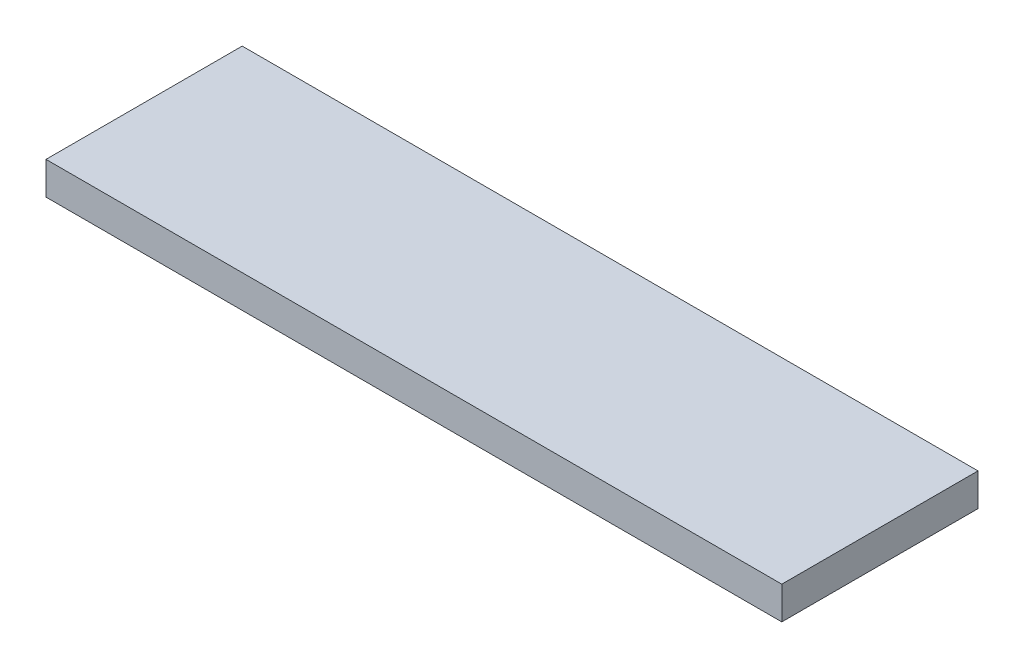
ISO-10303-21;
HEADER;
FILE_DESCRIPTION(('STEP AP214'),'2;1');
FILE_NAME('part.step','',(''),(''),'','','');
FILE_SCHEMA(('AUTOMOTIVE_DESIGN { 1 0 10303 214 1 1 1 1 }'));
ENDSEC;
DATA;
#1=APPLICATION_CONTEXT('core data for automotive mechanical design processes');
#2=APPLICATION_PROTOCOL_DEFINITION('international standard','automotive_design',2000,#1);
#3=PRODUCT_CONTEXT('',#1,'mechanical');
#4=PRODUCT('Part','Part','',(#3));
#5=PRODUCT_RELATED_PRODUCT_CATEGORY('part','',(#4));
#6=PRODUCT_DEFINITION_FORMATION('','',#4);
#7=PRODUCT_DEFINITION_CONTEXT('part definition',#1,'design');
#8=PRODUCT_DEFINITION('design','',#6,#7);
#9=PRODUCT_DEFINITION_SHAPE('','',#8);
#10=(LENGTH_UNIT() NAMED_UNIT(*) SI_UNIT(.MILLI.,.METRE.));
#11=(NAMED_UNIT(*) PLANE_ANGLE_UNIT() SI_UNIT($,.RADIAN.));
#12=(NAMED_UNIT(*) SI_UNIT($,.STERADIAN.) SOLID_ANGLE_UNIT());
#13=UNCERTAINTY_MEASURE_WITH_UNIT(LENGTH_MEASURE(1.E-05),#10,'distance_accuracy_value','');
#14=(GEOMETRIC_REPRESENTATION_CONTEXT(3) GLOBAL_UNCERTAINTY_ASSIGNED_CONTEXT((#13)) GLOBAL_UNIT_ASSIGNED_CONTEXT((#10,
#11,#12)) REPRESENTATION_CONTEXT('',''));
#15=CARTESIAN_POINT('',(0.,0.,0.));
#16=DIRECTION('',(0.,0.,1.));
#17=DIRECTION('',(1.,0.,0.));
#18=AXIS2_PLACEMENT_3D('',#15,#16,#17);
#19=CARTESIAN_POINT('',(0.,12.7,0.));
#20=DIRECTION('',(1.,0.,0.));
#21=DIRECTION('',(0.,0.,-1.));
#22=AXIS2_PLACEMENT_3D('',#19,#20,#21);
#23=PLANE('',#22);
#24=DIRECTION('',(0.,0.,1.));
#25=VECTOR('',#24,1.);
#26=CARTESIAN_POINT('',(0.,0.,0.));
#27=LINE('',#26,#25);
#28=CARTESIAN_POINT('',(0.,0.,-76.2));
#29=VERTEX_POINT('',#28);
#30=CARTESIAN_POINT('',(0.,0.,0.));
#31=VERTEX_POINT('',#30);
#32=EDGE_CURVE('E97',#29,#31,#27,.T.);
#33=ORIENTED_EDGE('',*,*,#32,.T.);
#34=DIRECTION('',(0.,-1.,0.));
#35=VECTOR('',#34,1.);
#36=CARTESIAN_POINT('',(0.,12.7,0.));
#37=LINE('',#36,#35);
#38=CARTESIAN_POINT('',(0.,12.7,0.));
#39=VERTEX_POINT('',#38);
#40=EDGE_CURVE('E11',#39,#31,#37,.T.);
#41=ORIENTED_EDGE('',*,*,#40,.F.);
#42=DIRECTION('',(0.,0.,1.));
#43=VECTOR('',#42,1.);
#44=CARTESIAN_POINT('',(0.,12.7,0.));
#45=LINE('',#44,#43);
#46=CARTESIAN_POINT('',(0.,12.7,-76.2));
#47=VERTEX_POINT('',#46);
#48=EDGE_CURVE('E85',#47,#39,#45,.T.);
#49=ORIENTED_EDGE('',*,*,#48,.F.);
#50=DIRECTION('',(0.,-1.,0.));
#51=VECTOR('',#50,1.);
#52=CARTESIAN_POINT('',(0.,12.7,-76.2));
#53=LINE('',#52,#51);
#54=EDGE_CURVE('E93',#47,#29,#53,.T.);
#55=ORIENTED_EDGE('',*,*,#54,.T.);
#56=EDGE_LOOP('',(#33,#41,#49,#55));
#57=FACE_BOUND('',#56,.T.);
#58=ADVANCED_FACE('F34',(#57),#23,.F.);
#59=CARTESIAN_POINT('',(0.,12.7,0.));
#60=DIRECTION('',(0.,0.,-1.));
#61=DIRECTION('',(-1.,0.,0.));
#62=AXIS2_PLACEMENT_3D('',#59,#60,#61);
#63=PLANE('',#62);
#64=DIRECTION('',(1.,0.,0.));
#65=VECTOR('',#64,1.);
#66=CARTESIAN_POINT('',(0.,0.,0.));
#67=LINE('',#66,#65);
#68=CARTESIAN_POINT('',(285.75,0.,0.));
#69=VERTEX_POINT('',#68);
#70=EDGE_CURVE('E89',#31,#69,#67,.T.);
#71=ORIENTED_EDGE('',*,*,#70,.T.);
#72=DIRECTION('',(0.,-1.,0.));
#73=VECTOR('',#72,1.);
#74=CARTESIAN_POINT('',(285.75,12.7,0.));
#75=LINE('',#74,#73);
#76=CARTESIAN_POINT('',(285.75,12.7,0.));
#77=VERTEX_POINT('',#76);
#78=EDGE_CURVE('E42',#77,#69,#75,.T.);
#79=ORIENTED_EDGE('',*,*,#78,.F.);
#80=DIRECTION('',(1.,0.,0.));
#81=VECTOR('',#80,1.);
#82=CARTESIAN_POINT('',(0.,12.7,0.));
#83=LINE('',#82,#81);
#84=EDGE_CURVE('E80',#39,#77,#83,.T.);
#85=ORIENTED_EDGE('',*,*,#84,.F.);
#86=ORIENTED_EDGE('',*,*,#40,.T.);
#87=EDGE_LOOP('',(#71,#79,#85,#86));
#88=FACE_BOUND('',#87,.T.);
#89=ADVANCED_FACE('F88',(#88),#63,.F.);
#90=CARTESIAN_POINT('',(285.75,12.7,0.));
#91=DIRECTION('',(-1.,0.,0.));
#92=DIRECTION('',(0.,0.,1.));
#93=AXIS2_PLACEMENT_3D('',#90,#91,#92);
#94=PLANE('',#93);
#95=DIRECTION('',(0.,0.,-1.));
#96=VECTOR('',#95,1.);
#97=CARTESIAN_POINT('',(285.75,0.,0.));
#98=LINE('',#97,#96);
#99=CARTESIAN_POINT('',(285.75,0.,-76.2));
#100=VERTEX_POINT('',#99);
#101=EDGE_CURVE('E67',#69,#100,#98,.T.);
#102=ORIENTED_EDGE('',*,*,#101,.T.);
#103=DIRECTION('',(0.,-1.,0.));
#104=VECTOR('',#103,1.);
#105=CARTESIAN_POINT('',(285.75,12.7,-76.2));
#106=LINE('',#105,#104);
#107=CARTESIAN_POINT('',(285.75,12.7,-76.2));
#108=VERTEX_POINT('',#107);
#109=EDGE_CURVE('E90',#108,#100,#106,.T.);
#110=ORIENTED_EDGE('',*,*,#109,.F.);
#111=DIRECTION('',(0.,0.,-1.));
#112=VECTOR('',#111,1.);
#113=CARTESIAN_POINT('',(285.75,12.7,0.));
#114=LINE('',#113,#112);
#115=EDGE_CURVE('E83',#77,#108,#114,.T.);
#116=ORIENTED_EDGE('',*,*,#115,.F.);
#117=ORIENTED_EDGE('',*,*,#78,.T.);
#118=EDGE_LOOP('',(#102,#110,#116,#117));
#119=FACE_BOUND('',#118,.T.);
#120=ADVANCED_FACE('F91',(#119),#94,.F.);
#121=CARTESIAN_POINT('',(0.,12.7,-76.2));
#122=DIRECTION('',(0.,0.,1.));
#123=DIRECTION('',(1.,0.,0.));
#124=AXIS2_PLACEMENT_3D('',#121,#122,#123);
#125=PLANE('',#124);
#126=DIRECTION('',(-1.,0.,0.));
#127=VECTOR('',#126,1.);
#128=CARTESIAN_POINT('',(0.,0.,-76.2));
#129=LINE('',#128,#127);
#130=EDGE_CURVE('E73',#100,#29,#129,.T.);
#131=ORIENTED_EDGE('',*,*,#130,.T.);
#132=ORIENTED_EDGE('',*,*,#54,.F.);
#133=DIRECTION('',(-1.,0.,0.));
#134=VECTOR('',#133,1.);
#135=CARTESIAN_POINT('',(0.,12.7,-76.2));
#136=LINE('',#135,#134);
#137=EDGE_CURVE('E50',#108,#47,#136,.T.);
#138=ORIENTED_EDGE('',*,*,#137,.F.);
#139=ORIENTED_EDGE('',*,*,#109,.T.);
#140=EDGE_LOOP('',(#131,#132,#138,#139));
#141=FACE_BOUND('',#140,.T.);
#142=ADVANCED_FACE('F104',(#141),#125,.F.);
#143=CARTESIAN_POINT('',(0.,12.7,-76.2));
#144=DIRECTION('',(0.,-1.,0.));
#145=DIRECTION('',(0.,0.,-1.));
#146=AXIS2_PLACEMENT_3D('',#143,#144,#145);
#147=PLANE('',#146);
#148=ORIENTED_EDGE('',*,*,#48,.T.);
#149=ORIENTED_EDGE('',*,*,#84,.T.);
#150=ORIENTED_EDGE('',*,*,#115,.T.);
#151=ORIENTED_EDGE('',*,*,#137,.T.);
#152=EDGE_LOOP('',(#148,#149,#150,#151));
#153=FACE_BOUND('',#152,.T.);
#154=ADVANCED_FACE('F81',(#153),#147,.F.);
#155=CARTESIAN_POINT('',(0.,0.,-76.2));
#156=DIRECTION('',(0.,-1.,0.));
#157=DIRECTION('',(0.,0.,-1.));
#158=AXIS2_PLACEMENT_3D('',#155,#156,#157);
#159=PLANE('',#158);
#160=ORIENTED_EDGE('',*,*,#32,.F.);
#161=ORIENTED_EDGE('',*,*,#130,.F.);
#162=ORIENTED_EDGE('',*,*,#101,.F.);
#163=ORIENTED_EDGE('',*,*,#70,.F.);
#164=EDGE_LOOP('',(#160,#161,#162,#163));
#165=FACE_BOUND('',#164,.T.);
#166=ADVANCED_FACE('F107',(#165),#159,.T.);
#167=CLOSED_SHELL('',(#58,#89,#120,#142,#154,#166));
#168=MANIFOLD_SOLID_BREP('B2',#167);
#169=ADVANCED_BREP_SHAPE_REPRESENTATION('',(#18,#168),#14);
#170=SHAPE_DEFINITION_REPRESENTATION(#9,#169);
ENDSEC;
END-ISO-10303-21;
